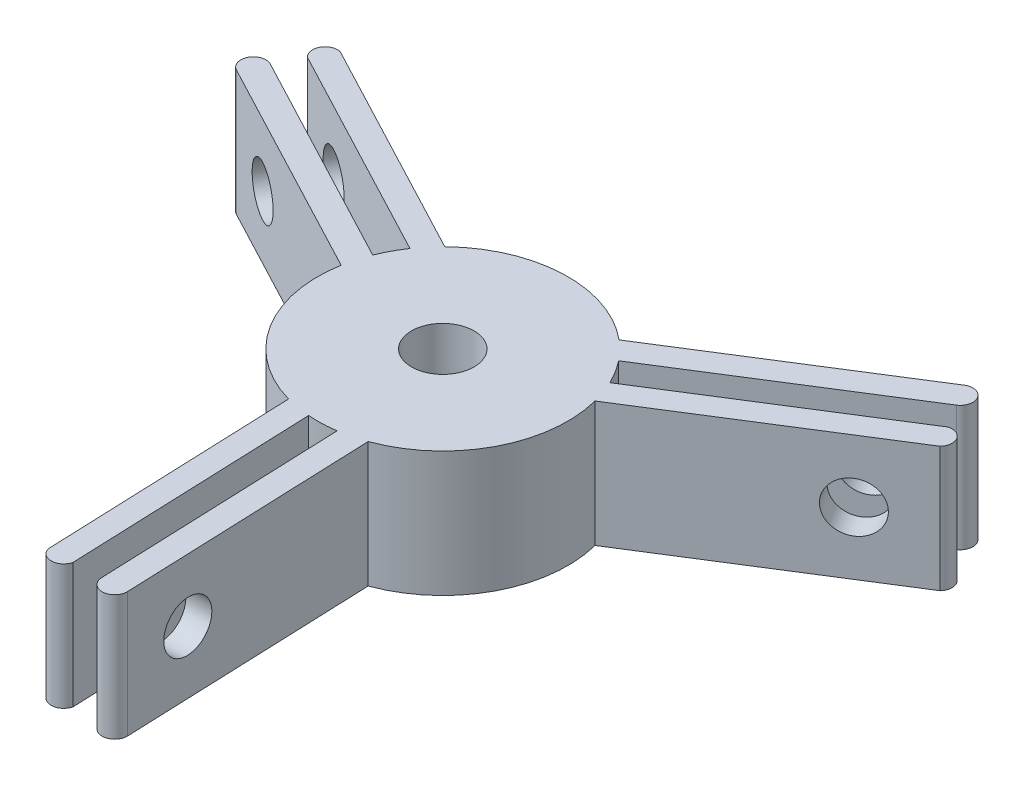
ISO-10303-21;
HEADER;
FILE_DESCRIPTION(('STEP AP214'),'2;1');
FILE_NAME('part.step','',(''),(''),'','','');
FILE_SCHEMA(('AUTOMOTIVE_DESIGN { 1 0 10303 214 1 1 1 1 }'));
ENDSEC;
DATA;
#1=APPLICATION_CONTEXT('core data for automotive mechanical design processes');
#2=APPLICATION_PROTOCOL_DEFINITION('international standard','automotive_design',2000,#1);
#3=PRODUCT_CONTEXT('',#1,'mechanical');
#4=PRODUCT('Part','Part','',(#3));
#5=PRODUCT_RELATED_PRODUCT_CATEGORY('part','',(#4));
#6=PRODUCT_DEFINITION_FORMATION('','',#4);
#7=PRODUCT_DEFINITION_CONTEXT('part definition',#1,'design');
#8=PRODUCT_DEFINITION('design','',#6,#7);
#9=PRODUCT_DEFINITION_SHAPE('','',#8);
#10=(LENGTH_UNIT() NAMED_UNIT(*) SI_UNIT(.MILLI.,.METRE.));
#11=(NAMED_UNIT(*) PLANE_ANGLE_UNIT() SI_UNIT($,.RADIAN.));
#12=(NAMED_UNIT(*) SI_UNIT($,.STERADIAN.) SOLID_ANGLE_UNIT());
#13=UNCERTAINTY_MEASURE_WITH_UNIT(LENGTH_MEASURE(1.E-05),#10,'distance_accuracy_value','');
#14=(GEOMETRIC_REPRESENTATION_CONTEXT(3) GLOBAL_UNCERTAINTY_ASSIGNED_CONTEXT((#13)) GLOBAL_UNIT_ASSIGNED_CONTEXT((#10,
#11,#12)) REPRESENTATION_CONTEXT('',''));
#15=CARTESIAN_POINT('',(0.,0.,0.));
#16=DIRECTION('',(0.,0.,1.));
#17=DIRECTION('',(1.,0.,0.));
#18=AXIS2_PLACEMENT_3D('',#15,#16,#17);
#19=CARTESIAN_POINT('',(0.,10.,0.));
#20=DIRECTION('',(0.,1.,0.));
#21=DIRECTION('',(0.,0.,1.));
#22=AXIS2_PLACEMENT_3D('',#19,#20,#21);
#23=PLANE('',#22);
#24=CARTESIAN_POINT('',(0.,10.,0.));
#25=DIRECTION('',(0.,1.,0.));
#26=DIRECTION('',(0.,0.,1.));
#27=AXIS2_PLACEMENT_3D('',#24,#25,#26);
#28=CIRCLE('',#27,10.);
#29=CARTESIAN_POINT('',(9.01148587106745,10.,-4.33510350459499));
#30=VERTEX_POINT('',#29);
#31=CARTESIAN_POINT('',(7.84546468512186,10.,-6.20070027291319));
#32=VERTEX_POINT('',#31);
#33=EDGE_CURVE('E275',#30,#32,#28,.T.);
#34=ORIENTED_EDGE('',*,*,#33,.T.);
#35=DIRECTION('',(0.846174424298782,0.,-0.532906036429149));
#36=VECTOR('',#35,1.);
#37=CARTESIAN_POINT('',(7.84546468512186,10.,-6.20070027291319));
#38=LINE('',#37,#36);
#39=CARTESIAN_POINT('',(24.4096415204676,10.,-16.6325327303295));
#40=VERTEX_POINT('',#39);
#41=EDGE_CURVE('E143',#32,#40,#38,.T.);
#42=ORIENTED_EDGE('',*,*,#41,.T.);
#43=CARTESIAN_POINT('',(23.8767354840384,10.,-17.4787071546283));
#44=DIRECTION('',(0.,1.,0.));
#45=DIRECTION('',(0.,0.,1.));
#46=AXIS2_PLACEMENT_3D('',#43,#44,#45);
#47=CIRCLE('',#46,1.);
#48=CARTESIAN_POINT('',(23.3438294476093,10.,-18.3248815789271));
#49=VERTEX_POINT('',#48);
#50=EDGE_CURVE('E338',#40,#49,#47,.T.);
#51=ORIENTED_EDGE('',*,*,#50,.T.);
#52=DIRECTION('',(-0.846174424298782,0.,0.532906036429149));
#53=VECTOR('',#52,1.);
#54=CARTESIAN_POINT('',(6.42034096163365,10.,-7.6667608503441));
#55=LINE('',#54,#53);
#56=CARTESIAN_POINT('',(6.42034096163365,10.,-7.6667608503441));
#57=VERTEX_POINT('',#56);
#58=EDGE_CURVE('E357',#49,#57,#55,.T.);
#59=ORIENTED_EDGE('',*,*,#58,.T.);
#60=CARTESIAN_POINT('',(0.,10.,0.));
#61=DIRECTION('',(0.,1.,0.));
#62=DIRECTION('',(0.,0.,1.));
#63=AXIS2_PLACEMENT_3D('',#60,#61,#62);
#64=CIRCLE('',#63,10.);
#65=CARTESIAN_POINT('',(-6.99010809505121,10.,-7.15111101993945));
#66=VERTEX_POINT('',#65);
#67=EDGE_CURVE('E354',#57,#66,#64,.T.);
#68=ORIENTED_EDGE('',*,*,#67,.T.);
#69=DIRECTION('',(-0.88459737752711,0.,-0.466355529260842));
#70=VECTOR('',#69,1.);
#71=CARTESIAN_POINT('',(-6.99010809505122,10.,-7.15111101993945));
#72=LINE('',#71,#70);
#73=CARTESIAN_POINT('',(-24.6820556455925,10.,-16.4782216051558));
#74=VERTEX_POINT('',#73);
#75=EDGE_CURVE('E356',#66,#74,#72,.T.);
#76=ORIENTED_EDGE('',*,*,#75,.T.);
#77=CARTESIAN_POINT('',(-24.9037683563406,10.,-15.5031095736985));
#78=DIRECTION('',(0.,1.,0.));
#79=DIRECTION('',(0.,0.,-1.));
#80=AXIS2_PLACEMENT_3D('',#77,#78,#79);
#81=CIRCLE('',#80,1.);
#82=CARTESIAN_POINT('',(-25.5830344696015,10.,-14.7692175193912));
#83=VERTEX_POINT('',#82);
#84=EDGE_CURVE('E359',#74,#83,#81,.T.);
#85=ORIENTED_EDGE('',*,*,#84,.T.);
#86=DIRECTION('',(0.88459737752711,0.,0.466355529260842));
#87=VECTOR('',#86,1.);
#88=CARTESIAN_POINT('',(-8.26005269854793,10.,-5.63662393789146));
#89=LINE('',#88,#87);
#90=CARTESIAN_POINT('',(-8.26005269854793,10.,-5.63662393789146));
#91=VERTEX_POINT('',#90);
#92=EDGE_CURVE('E365',#83,#91,#89,.T.);
#93=ORIENTED_EDGE('',*,*,#92,.T.);
#94=CARTESIAN_POINT('',(0.,10.,0.));
#95=DIRECTION('',(0.,1.,0.));
#96=DIRECTION('',(0.,0.,1.));
#97=AXIS2_PLACEMENT_3D('',#94,#95,#96);
#98=CIRCLE('',#97,10.);
#99=CARTESIAN_POINT('',(-9.29269630015686,10.,-3.69402158535262));
#100=VERTEX_POINT('',#99);
#101=EDGE_CURVE('E367',#91,#100,#98,.T.);
#102=ORIENTED_EDGE('',*,*,#101,.T.);
#103=DIRECTION('',(-0.88459737752711,0.,-0.466355529260842));
#104=VECTOR('',#103,1.);
#105=CARTESIAN_POINT('',(-9.29269630015686,10.,-3.69402158535262));
#106=LINE('',#105,#104);
#107=CARTESIAN_POINT('',(-26.6090166339753,10.,-12.8231032888316));
#108=VERTEX_POINT('',#107);
#109=EDGE_CURVE('E369',#100,#108,#106,.T.);
#110=ORIENTED_EDGE('',*,*,#109,.T.);
#111=CARTESIAN_POINT('',(-27.0753721632362,10.,-11.9385059113045));
#112=DIRECTION('',(0.,1.,0.));
#113=DIRECTION('',(0.,0.,1.));
#114=AXIS2_PLACEMENT_3D('',#111,#112,#113);
#115=CIRCLE('',#114,1.);
#116=CARTESIAN_POINT('',(-27.541727692497,10.,-11.0539085337773));
#117=VERTEX_POINT('',#116);
#118=EDGE_CURVE('E371',#108,#117,#115,.T.);
#119=ORIENTED_EDGE('',*,*,#118,.T.);
#120=DIRECTION('',(0.88459737752711,0.,0.466355529260842));
#121=VECTOR('',#120,1.);
#122=CARTESIAN_POINT('',(-9.8497801419548,10.,-1.7267979485605));
#123=LINE('',#122,#121);
#124=CARTESIAN_POINT('',(-9.8497801419548,10.,-1.7267979485605));
#125=VERTEX_POINT('',#124);
#126=EDGE_CURVE('E373',#117,#125,#123,.T.);
#127=ORIENTED_EDGE('',*,*,#126,.T.);
#128=CARTESIAN_POINT('',(0.,10.,0.));
#129=DIRECTION('',(0.,1.,0.));
#130=DIRECTION('',(0.,0.,1.));
#131=AXIS2_PLACEMENT_3D('',#128,#129,#130);
#132=CIRCLE('',#131,10.);
#133=CARTESIAN_POINT('',(-2.69798976102481,10.,9.62916669548333));
#134=VERTEX_POINT('',#133);
#135=EDGE_CURVE('E375',#125,#134,#132,.T.);
#136=ORIENTED_EDGE('',*,*,#135,.T.);
#137=DIRECTION('',(0.0384229532283287,0.,0.999261565689992));
#138=VECTOR('',#137,1.);
#139=CARTESIAN_POINT('',(-2.69798976102481,10.,9.62916669548333));
#140=LINE('',#139,#138);
#141=CARTESIAN_POINT('',(-1.92953069645827,10.,29.6143980092821));
#142=VERTEX_POINT('',#141);
#143=EDGE_CURVE('E377',#134,#142,#140,.T.);
#144=ORIENTED_EDGE('',*,*,#143,.T.);
#145=CARTESIAN_POINT('',(-0.974202550306361,10.,29.3188508334032));
#146=DIRECTION('',(0.,1.,0.));
#147=DIRECTION('',(0.,0.,-1.));
#148=AXIS2_PLACEMENT_3D('',#145,#146,#147);
#149=CIRCLE('',#148,0.999999999999999);
#150=CARTESIAN_POINT('',(0.000999668989778838,10.,29.5401665162634));
#151=VERTEX_POINT('',#150);
#152=EDGE_CURVE('E379',#142,#151,#149,.T.);
#153=ORIENTED_EDGE('',*,*,#152,.T.);
#154=DIRECTION('',(-0.0384229532283282,0.,-0.999261565689992));
#155=VECTOR('',#154,1.);
#156=CARTESIAN_POINT('',(-0.751433172519515,10.,9.97172744248644));
#157=LINE('',#156,#155);
#158=CARTESIAN_POINT('',(-0.751433172519515,10.,9.97172744248644));
#159=VERTEX_POINT('',#158);
#160=EDGE_CURVE('E381',#151,#159,#157,.T.);
#161=ORIENTED_EDGE('',*,*,#160,.T.);
#162=CARTESIAN_POINT('',(0.,10.,0.));
#163=DIRECTION('',(0.,1.,0.));
#164=DIRECTION('',(0.,0.,1.));
#165=AXIS2_PLACEMENT_3D('',#162,#163,#164);
#166=CIRCLE('',#165,10.);
#167=CARTESIAN_POINT('',(1.44723161503499,10.,9.89472185826581));
#168=VERTEX_POINT('',#167);
#169=EDGE_CURVE('E383',#159,#168,#166,.T.);
#170=ORIENTED_EDGE('',*,*,#169,.T.);
#171=DIRECTION('',(0.0384229532283283,0.,0.999261565689992));
#172=VECTOR('',#171,1.);
#173=CARTESIAN_POINT('',(1.44723161503499,10.,9.89472185826581));
#174=LINE('',#173,#172);
#175=CARTESIAN_POINT('',(2.19937511350774,10.,29.4556360191611));
#176=VERTEX_POINT('',#175);
#177=EDGE_CURVE('E385',#168,#176,#174,.T.);
#178=ORIENTED_EDGE('',*,*,#177,.T.);
#179=CARTESIAN_POINT('',(3.19863667919775,10.,29.4172130659328));
#180=DIRECTION('',(0.,1.,0.));
#181=DIRECTION('',(0.,0.,1.));
#182=AXIS2_PLACEMENT_3D('',#179,#180,#181);
#183=CIRCLE('',#182,1.);
#184=CARTESIAN_POINT('',(4.19789824488775,10.,29.3787901127044));
#185=VERTEX_POINT('',#184);
#186=EDGE_CURVE('E387',#176,#185,#183,.T.);
#187=ORIENTED_EDGE('',*,*,#186,.T.);
#188=DIRECTION('',(-0.0384229532283283,0.,-0.999261565689992));
#189=VECTOR('',#188,1.);
#190=CARTESIAN_POINT('',(3.42943918032116,10.,9.3935587989046));
#191=LINE('',#190,#189);
#192=CARTESIAN_POINT('',(3.42943918032116,10.,9.3935587989046));
#193=VERTEX_POINT('',#192);
#194=EDGE_CURVE('E389',#185,#193,#191,.T.);
#195=ORIENTED_EDGE('',*,*,#194,.T.);
#196=CARTESIAN_POINT('',(0.,10.,0.));
#197=DIRECTION('',(0.,1.,0.));
#198=DIRECTION('',(0.,0.,1.));
#199=AXIS2_PLACEMENT_3D('',#196,#197,#198);
#200=CIRCLE('',#199,10.);
#201=CARTESIAN_POINT('',(9.68809785607602,10.,-2.47805567554387));
#202=VERTEX_POINT('',#201);
#203=EDGE_CURVE('E210',#193,#202,#200,.T.);
#204=ORIENTED_EDGE('',*,*,#203,.T.);
#205=DIRECTION('',(0.846174424298781,0.,-0.53290603642915));
#206=VECTOR('',#205,1.);
#207=CARTESIAN_POINT('',(9.68809785607602,10.,-2.47805567554387));
#208=LINE('',#207,#206);
#209=CARTESIAN_POINT('',(26.6115863420508,10.,-13.1361764041263));
#210=VERTEX_POINT('',#209);
#211=EDGE_CURVE('E204',#202,#210,#208,.T.);
#212=ORIENTED_EDGE('',*,*,#211,.T.);
#213=CARTESIAN_POINT('',(25.8779709066469,10.,-13.8157412597047));
#214=DIRECTION('',(0.,1.,0.));
#215=DIRECTION('',(0.,0.,-1.));
#216=AXIS2_PLACEMENT_3D('',#213,#214,#215);
#217=CIRCLE('',#216,1.);
#218=CARTESIAN_POINT('',(25.5820348006117,10.,-14.7709489968722));
#219=VERTEX_POINT('',#218);
#220=EDGE_CURVE('E208',#210,#219,#217,.T.);
#221=ORIENTED_EDGE('',*,*,#220,.T.);
#222=DIRECTION('',(-0.846174424298781,0.,0.532906036429149));
#223=VECTOR('',#222,1.);
#224=CARTESIAN_POINT('',(9.01148587106745,10.,-4.33510350459499));
#225=LINE('',#224,#223);
#226=EDGE_CURVE('E52',#219,#30,#225,.T.);
#227=ORIENTED_EDGE('',*,*,#226,.T.);
#228=EDGE_LOOP('',(#34,#42,#51,#59,#68,#76,#85,#93,#102,#110,#119,#127,#136,#144,#153,#161,#170,
#178,#187,#195,#204,#212,#221,#227));
#229=FACE_BOUND('',#228,.T.);
#230=CARTESIAN_POINT('',(0.,10.,0.));
#231=DIRECTION('',(0.,1.,0.));
#232=DIRECTION('',(0.,0.,1.));
#233=AXIS2_PLACEMENT_3D('',#230,#231,#232);
#234=CIRCLE('',#233,2.5);
#235=CARTESIAN_POINT('',(0.,10.,2.5));
#236=VERTEX_POINT('',#235);
#237=EDGE_CURVE('E232',#236,#236,#234,.T.);
#238=ORIENTED_EDGE('',*,*,#237,.F.);
#239=EDGE_LOOP('',(#238));
#240=FACE_BOUND('',#239,.T.);
#241=ADVANCED_FACE('F35',(#229,#240),#23,.T.);
#242=CARTESIAN_POINT('',(0.,0.,0.));
#243=DIRECTION('',(0.,1.,0.));
#244=DIRECTION('',(0.,0.,1.));
#245=AXIS2_PLACEMENT_3D('',#242,#243,#244);
#246=PLANE('',#245);
#247=CARTESIAN_POINT('',(0.,0.,0.));
#248=DIRECTION('',(0.,1.,0.));
#249=DIRECTION('',(0.,0.,1.));
#250=AXIS2_PLACEMENT_3D('',#247,#248,#249);
#251=CIRCLE('',#250,10.);
#252=CARTESIAN_POINT('',(9.01148587106745,0.,-4.33510350459499));
#253=VERTEX_POINT('',#252);
#254=CARTESIAN_POINT('',(7.84546468512186,0.,-6.20070027291319));
#255=VERTEX_POINT('',#254);
#256=EDGE_CURVE('E228',#253,#255,#251,.T.);
#257=ORIENTED_EDGE('',*,*,#256,.F.);
#258=DIRECTION('',(-0.846174424298781,0.,0.532906036429149));
#259=VECTOR('',#258,1.);
#260=CARTESIAN_POINT('',(9.01148587106745,0.,-4.33510350459499));
#261=LINE('',#260,#259);
#262=CARTESIAN_POINT('',(25.5820348006117,0.,-14.7709489968722));
#263=VERTEX_POINT('',#262);
#264=EDGE_CURVE('E135',#263,#253,#261,.T.);
#265=ORIENTED_EDGE('',*,*,#264,.F.);
#266=CARTESIAN_POINT('',(25.8779709066469,0.,-13.8157412597047));
#267=DIRECTION('',(0.,1.,0.));
#268=DIRECTION('',(0.,0.,-1.));
#269=AXIS2_PLACEMENT_3D('',#266,#267,#268);
#270=CIRCLE('',#269,1.);
#271=CARTESIAN_POINT('',(26.6115863420508,0.,-13.1361764041263));
#272=VERTEX_POINT('',#271);
#273=EDGE_CURVE('E129',#272,#263,#270,.T.);
#274=ORIENTED_EDGE('',*,*,#273,.F.);
#275=DIRECTION('',(0.846174424298781,0.,-0.53290603642915));
#276=VECTOR('',#275,1.);
#277=CARTESIAN_POINT('',(9.68809785607602,0.,-2.47805567554387));
#278=LINE('',#277,#276);
#279=CARTESIAN_POINT('',(9.68809785607602,0.,-2.47805567554387));
#280=VERTEX_POINT('',#279);
#281=EDGE_CURVE('E218',#280,#272,#278,.T.);
#282=ORIENTED_EDGE('',*,*,#281,.F.);
#283=CARTESIAN_POINT('',(0.,0.,0.));
#284=DIRECTION('',(0.,1.,0.));
#285=DIRECTION('',(0.,0.,1.));
#286=AXIS2_PLACEMENT_3D('',#283,#284,#285);
#287=CIRCLE('',#286,10.);
#288=CARTESIAN_POINT('',(3.42943918032116,0.,9.3935587989046));
#289=VERTEX_POINT('',#288);
#290=EDGE_CURVE('E270',#289,#280,#287,.T.);
#291=ORIENTED_EDGE('',*,*,#290,.F.);
#292=DIRECTION('',(-0.0384229532283283,0.,-0.999261565689992));
#293=VECTOR('',#292,1.);
#294=CARTESIAN_POINT('',(3.42943918032116,0.,9.3935587989046));
#295=LINE('',#294,#293);
#296=CARTESIAN_POINT('',(4.19789824488775,0.,29.3787901127044));
#297=VERTEX_POINT('',#296);
#298=EDGE_CURVE('E268',#297,#289,#295,.T.);
#299=ORIENTED_EDGE('',*,*,#298,.F.);
#300=CARTESIAN_POINT('',(3.19863667919775,0.,29.4172130659328));
#301=DIRECTION('',(0.,1.,0.));
#302=DIRECTION('',(0.,0.,1.));
#303=AXIS2_PLACEMENT_3D('',#300,#301,#302);
#304=CIRCLE('',#303,1.);
#305=CARTESIAN_POINT('',(2.19937511350774,0.,29.4556360191611));
#306=VERTEX_POINT('',#305);
#307=EDGE_CURVE('E266',#306,#297,#304,.T.);
#308=ORIENTED_EDGE('',*,*,#307,.F.);
#309=DIRECTION('',(0.0384229532283283,0.,0.999261565689992));
#310=VECTOR('',#309,1.);
#311=CARTESIAN_POINT('',(1.44723161503499,0.,9.89472185826581));
#312=LINE('',#311,#310);
#313=CARTESIAN_POINT('',(1.44723161503499,0.,9.89472185826581));
#314=VERTEX_POINT('',#313);
#315=EDGE_CURVE('E264',#314,#306,#312,.T.);
#316=ORIENTED_EDGE('',*,*,#315,.F.);
#317=CARTESIAN_POINT('',(0.,0.,0.));
#318=DIRECTION('',(0.,1.,0.));
#319=DIRECTION('',(0.,0.,1.));
#320=AXIS2_PLACEMENT_3D('',#317,#318,#319);
#321=CIRCLE('',#320,10.);
#322=CARTESIAN_POINT('',(-0.751433172519515,0.,9.97172744248644));
#323=VERTEX_POINT('',#322);
#324=EDGE_CURVE('E262',#323,#314,#321,.T.);
#325=ORIENTED_EDGE('',*,*,#324,.F.);
#326=DIRECTION('',(-0.0384229532283282,0.,-0.999261565689992));
#327=VECTOR('',#326,1.);
#328=CARTESIAN_POINT('',(-0.751433172519515,0.,9.97172744248644));
#329=LINE('',#328,#327);
#330=CARTESIAN_POINT('',(0.000999668989778838,0.,29.5401665162634));
#331=VERTEX_POINT('',#330);
#332=EDGE_CURVE('E260',#331,#323,#329,.T.);
#333=ORIENTED_EDGE('',*,*,#332,.F.);
#334=CARTESIAN_POINT('',(-0.974202550306361,0.,29.3188508334032));
#335=DIRECTION('',(0.,1.,0.));
#336=DIRECTION('',(0.,0.,-1.));
#337=AXIS2_PLACEMENT_3D('',#334,#335,#336);
#338=CIRCLE('',#337,0.999999999999999);
#339=CARTESIAN_POINT('',(-1.92953069645827,0.,29.6143980092821));
#340=VERTEX_POINT('',#339);
#341=EDGE_CURVE('E258',#340,#331,#338,.T.);
#342=ORIENTED_EDGE('',*,*,#341,.F.);
#343=DIRECTION('',(0.0384229532283287,0.,0.999261565689992));
#344=VECTOR('',#343,1.);
#345=CARTESIAN_POINT('',(-2.69798976102481,0.,9.62916669548333));
#346=LINE('',#345,#344);
#347=CARTESIAN_POINT('',(-2.69798976102481,0.,9.62916669548333));
#348=VERTEX_POINT('',#347);
#349=EDGE_CURVE('E256',#348,#340,#346,.T.);
#350=ORIENTED_EDGE('',*,*,#349,.F.);
#351=CARTESIAN_POINT('',(0.,0.,0.));
#352=DIRECTION('',(0.,1.,0.));
#353=DIRECTION('',(0.,0.,1.));
#354=AXIS2_PLACEMENT_3D('',#351,#352,#353);
#355=CIRCLE('',#354,10.);
#356=CARTESIAN_POINT('',(-9.8497801419548,0.,-1.7267979485605));
#357=VERTEX_POINT('',#356);
#358=EDGE_CURVE('E254',#357,#348,#355,.T.);
#359=ORIENTED_EDGE('',*,*,#358,.F.);
#360=DIRECTION('',(0.88459737752711,0.,0.466355529260842));
#361=VECTOR('',#360,1.);
#362=CARTESIAN_POINT('',(-9.8497801419548,0.,-1.7267979485605));
#363=LINE('',#362,#361);
#364=CARTESIAN_POINT('',(-27.541727692497,0.,-11.0539085337773));
#365=VERTEX_POINT('',#364);
#366=EDGE_CURVE('E252',#365,#357,#363,.T.);
#367=ORIENTED_EDGE('',*,*,#366,.F.);
#368=CARTESIAN_POINT('',(-27.0753721632362,0.,-11.9385059113045));
#369=DIRECTION('',(0.,1.,0.));
#370=DIRECTION('',(0.,0.,1.));
#371=AXIS2_PLACEMENT_3D('',#368,#369,#370);
#372=CIRCLE('',#371,1.);
#373=CARTESIAN_POINT('',(-26.6090166339753,0.,-12.8231032888316));
#374=VERTEX_POINT('',#373);
#375=EDGE_CURVE('E250',#374,#365,#372,.T.);
#376=ORIENTED_EDGE('',*,*,#375,.F.);
#377=DIRECTION('',(-0.88459737752711,0.,-0.466355529260842));
#378=VECTOR('',#377,1.);
#379=CARTESIAN_POINT('',(-9.29269630015686,0.,-3.69402158535262));
#380=LINE('',#379,#378);
#381=CARTESIAN_POINT('',(-9.29269630015686,0.,-3.69402158535262));
#382=VERTEX_POINT('',#381);
#383=EDGE_CURVE('E248',#382,#374,#380,.T.);
#384=ORIENTED_EDGE('',*,*,#383,.F.);
#385=CARTESIAN_POINT('',(0.,0.,0.));
#386=DIRECTION('',(0.,1.,0.));
#387=DIRECTION('',(0.,0.,1.));
#388=AXIS2_PLACEMENT_3D('',#385,#386,#387);
#389=CIRCLE('',#388,10.);
#390=CARTESIAN_POINT('',(-8.26005269854793,0.,-5.63662393789146));
#391=VERTEX_POINT('',#390);
#392=EDGE_CURVE('E246',#391,#382,#389,.T.);
#393=ORIENTED_EDGE('',*,*,#392,.F.);
#394=DIRECTION('',(0.88459737752711,0.,0.466355529260842));
#395=VECTOR('',#394,1.);
#396=CARTESIAN_POINT('',(-8.26005269854793,0.,-5.63662393789146));
#397=LINE('',#396,#395);
#398=CARTESIAN_POINT('',(-25.5830344696015,0.,-14.7692175193912));
#399=VERTEX_POINT('',#398);
#400=EDGE_CURVE('E244',#399,#391,#397,.T.);
#401=ORIENTED_EDGE('',*,*,#400,.F.);
#402=CARTESIAN_POINT('',(-24.9037683563406,0.,-15.5031095736985));
#403=DIRECTION('',(0.,1.,0.));
#404=DIRECTION('',(0.,0.,-1.));
#405=AXIS2_PLACEMENT_3D('',#402,#403,#404);
#406=CIRCLE('',#405,1.);
#407=CARTESIAN_POINT('',(-24.6820556455925,0.,-16.4782216051558));
#408=VERTEX_POINT('',#407);
#409=EDGE_CURVE('E242',#408,#399,#406,.T.);
#410=ORIENTED_EDGE('',*,*,#409,.F.);
#411=DIRECTION('',(-0.88459737752711,0.,-0.466355529260842));
#412=VECTOR('',#411,1.);
#413=CARTESIAN_POINT('',(-6.99010809505122,0.,-7.15111101993945));
#414=LINE('',#413,#412);
#415=CARTESIAN_POINT('',(-6.99010809505121,0.,-7.15111101993945));
#416=VERTEX_POINT('',#415);
#417=EDGE_CURVE('E240',#416,#408,#414,.T.);
#418=ORIENTED_EDGE('',*,*,#417,.F.);
#419=CARTESIAN_POINT('',(0.,0.,0.));
#420=DIRECTION('',(0.,1.,0.));
#421=DIRECTION('',(0.,0.,1.));
#422=AXIS2_PLACEMENT_3D('',#419,#420,#421);
#423=CIRCLE('',#422,10.);
#424=CARTESIAN_POINT('',(6.42034096163365,0.,-7.6667608503441));
#425=VERTEX_POINT('',#424);
#426=EDGE_CURVE('E238',#425,#416,#423,.T.);
#427=ORIENTED_EDGE('',*,*,#426,.F.);
#428=DIRECTION('',(-0.846174424298782,0.,0.532906036429149));
#429=VECTOR('',#428,1.);
#430=CARTESIAN_POINT('',(6.42034096163365,0.,-7.6667608503441));
#431=LINE('',#430,#429);
#432=CARTESIAN_POINT('',(23.3438294476093,0.,-18.3248815789271));
#433=VERTEX_POINT('',#432);
#434=EDGE_CURVE('E236',#433,#425,#431,.T.);
#435=ORIENTED_EDGE('',*,*,#434,.F.);
#436=CARTESIAN_POINT('',(23.8767354840384,0.,-17.4787071546283));
#437=DIRECTION('',(0.,1.,0.));
#438=DIRECTION('',(0.,0.,1.));
#439=AXIS2_PLACEMENT_3D('',#436,#437,#438);
#440=CIRCLE('',#439,1.);
#441=CARTESIAN_POINT('',(24.4096415204676,0.,-16.6325327303295));
#442=VERTEX_POINT('',#441);
#443=EDGE_CURVE('E234',#442,#433,#440,.T.);
#444=ORIENTED_EDGE('',*,*,#443,.F.);
#445=DIRECTION('',(0.846174424298782,0.,-0.532906036429149));
#446=VECTOR('',#445,1.);
#447=CARTESIAN_POINT('',(7.84546468512186,0.,-6.20070027291319));
#448=LINE('',#447,#446);
#449=EDGE_CURVE('E231',#255,#442,#448,.T.);
#450=ORIENTED_EDGE('',*,*,#449,.F.);
#451=EDGE_LOOP('',(#257,#265,#274,#282,#291,#299,#308,#316,#325,#333,#342,#350,#359,#367,#376,
#384,#393,#401,#410,#418,#427,#435,#444,#450));
#452=FACE_BOUND('',#451,.T.);
#453=CARTESIAN_POINT('',(0.,0.,0.));
#454=DIRECTION('',(0.,1.,0.));
#455=DIRECTION('',(0.,0.,1.));
#456=AXIS2_PLACEMENT_3D('',#453,#454,#455);
#457=CIRCLE('',#456,2.5);
#458=CARTESIAN_POINT('',(0.,0.,2.5));
#459=VERTEX_POINT('',#458);
#460=EDGE_CURVE('E485',#459,#459,#457,.T.);
#461=ORIENTED_EDGE('',*,*,#460,.T.);
#462=EDGE_LOOP('',(#461));
#463=FACE_BOUND('',#462,.T.);
#464=ADVANCED_FACE('F342',(#452,#463),#246,.F.);
#465=CARTESIAN_POINT('',(0.,10.,0.));
#466=DIRECTION('',(0.,-1.,0.));
#467=DIRECTION('',(0.,0.,-1.));
#468=AXIS2_PLACEMENT_3D('',#465,#466,#467);
#469=CYLINDRICAL_SURFACE('',#468,10.);
#470=ORIENTED_EDGE('',*,*,#256,.T.);
#471=DIRECTION('',(0.,-1.,0.));
#472=VECTOR('',#471,1.);
#473=CARTESIAN_POINT('',(7.84546468512186,10.,-6.20070027291319));
#474=LINE('',#473,#472);
#475=EDGE_CURVE('E11',#32,#255,#474,.T.);
#476=ORIENTED_EDGE('',*,*,#475,.F.);
#477=ORIENTED_EDGE('',*,*,#33,.F.);
#478=DIRECTION('',(0.,-1.,0.));
#479=VECTOR('',#478,1.);
#480=CARTESIAN_POINT('',(9.01148587106745,10.,-4.33510350459499));
#481=LINE('',#480,#479);
#482=EDGE_CURVE('E224',#30,#253,#481,.T.);
#483=ORIENTED_EDGE('',*,*,#482,.T.);
#484=EDGE_LOOP('',(#470,#476,#477,#483));
#485=FACE_BOUND('',#484,.T.);
#486=ADVANCED_FACE('F37',(#485),#469,.T.);
#487=CARTESIAN_POINT('',(7.84546468512186,10.,-6.20070027291319));
#488=DIRECTION('',(-0.532906036429149,0.,-0.846174424298782));
#489=DIRECTION('',(-0.846174424298782,0.,0.532906036429149));
#490=AXIS2_PLACEMENT_3D('',#487,#488,#489);
#491=PLANE('',#490);
#492=CARTESIAN_POINT('',(20.1787693989738,5.,-13.9680025481836));
#493=DIRECTION('',(-0.532906036429142,0.,-0.846174424298786));
#494=DIRECTION('',(-0.846174424298786,0.,0.532906036429142));
#495=AXIS2_PLACEMENT_3D('',#492,#493,#494);
#496=CIRCLE('',#495,2.);
#497=CARTESIAN_POINT('',(18.4864205503762,5.,-12.9021904753253));
#498=VERTEX_POINT('',#497);
#499=EDGE_CURVE('E451',#498,#498,#496,.T.);
#500=ORIENTED_EDGE('',*,*,#499,.T.);
#501=EDGE_LOOP('',(#500));
#502=FACE_BOUND('',#501,.T.);
#503=ORIENTED_EDGE('',*,*,#449,.T.);
#504=DIRECTION('',(0.,-1.,0.));
#505=VECTOR('',#504,1.);
#506=CARTESIAN_POINT('',(24.4096415204676,10.,-16.6325327303295));
#507=LINE('',#506,#505);
#508=EDGE_CURVE('E44',#40,#442,#507,.T.);
#509=ORIENTED_EDGE('',*,*,#508,.F.);
#510=ORIENTED_EDGE('',*,*,#41,.F.);
#511=ORIENTED_EDGE('',*,*,#475,.T.);
#512=EDGE_LOOP('',(#503,#509,#510,#511));
#513=FACE_BOUND('',#512,.T.);
#514=ADVANCED_FACE('F575',(#502,#513),#491,.F.);
#515=CARTESIAN_POINT('',(23.8767354840384,10.,-17.4787071546283));
#516=DIRECTION('',(0.,-1.,0.));
#517=DIRECTION('',(0.,0.,-1.));
#518=AXIS2_PLACEMENT_3D('',#515,#516,#517);
#519=CYLINDRICAL_SURFACE('',#518,1.);
#520=ORIENTED_EDGE('',*,*,#443,.T.);
#521=DIRECTION('',(0.,-1.,0.));
#522=VECTOR('',#521,1.);
#523=CARTESIAN_POINT('',(23.3438294476093,10.,-18.3248815789271));
#524=LINE('',#523,#522);
#525=EDGE_CURVE('E330',#49,#433,#524,.T.);
#526=ORIENTED_EDGE('',*,*,#525,.F.);
#527=ORIENTED_EDGE('',*,*,#50,.F.);
#528=ORIENTED_EDGE('',*,*,#508,.T.);
#529=EDGE_LOOP('',(#520,#526,#527,#528));
#530=FACE_BOUND('',#529,.T.);
#531=ADVANCED_FACE('F336',(#530),#519,.T.);
#532=CARTESIAN_POINT('',(6.42034096163365,10.,-7.6667608503441));
#533=DIRECTION('',(0.532906036429149,0.,0.846174424298782));
#534=DIRECTION('',(0.846174424298782,0.,-0.532906036429149));
#535=AXIS2_PLACEMENT_3D('',#532,#533,#534);
#536=PLANE('',#535);
#537=CARTESIAN_POINT('',(19.1129573261155,5.,-15.6603513967812));
#538=DIRECTION('',(-0.532906036429142,0.,-0.846174424298786));
#539=DIRECTION('',(-0.846174424298786,0.,0.532906036429142));
#540=AXIS2_PLACEMENT_3D('',#537,#538,#539);
#541=CIRCLE('',#540,2.);
#542=CARTESIAN_POINT('',(17.4206084775179,5.,-14.5945393239229));
#543=VERTEX_POINT('',#542);
#544=EDGE_CURVE('E448',#543,#543,#541,.T.);
#545=ORIENTED_EDGE('',*,*,#544,.F.);
#546=EDGE_LOOP('',(#545));
#547=FACE_BOUND('',#546,.T.);
#548=ORIENTED_EDGE('',*,*,#434,.T.);
#549=DIRECTION('',(0.,-1.,0.));
#550=VECTOR('',#549,1.);
#551=CARTESIAN_POINT('',(6.42034096163365,10.,-7.6667608503441));
#552=LINE('',#551,#550);
#553=EDGE_CURVE('E327',#57,#425,#552,.T.);
#554=ORIENTED_EDGE('',*,*,#553,.F.);
#555=ORIENTED_EDGE('',*,*,#58,.F.);
#556=ORIENTED_EDGE('',*,*,#525,.T.);
#557=EDGE_LOOP('',(#548,#554,#555,#556));
#558=FACE_BOUND('',#557,.T.);
#559=ADVANCED_FACE('F348',(#547,#558),#536,.F.);
#560=CARTESIAN_POINT('',(0.,10.,0.));
#561=DIRECTION('',(0.,-1.,0.));
#562=DIRECTION('',(0.,0.,-1.));
#563=AXIS2_PLACEMENT_3D('',#560,#561,#562);
#564=CYLINDRICAL_SURFACE('',#563,10.);
#565=ORIENTED_EDGE('',*,*,#426,.T.);
#566=DIRECTION('',(0.,-1.,0.));
#567=VECTOR('',#566,1.);
#568=CARTESIAN_POINT('',(-6.99010809505121,10.,-7.15111101993945));
#569=LINE('',#568,#567);
#570=EDGE_CURVE('E324',#66,#416,#569,.T.);
#571=ORIENTED_EDGE('',*,*,#570,.F.);
#572=ORIENTED_EDGE('',*,*,#67,.F.);
#573=ORIENTED_EDGE('',*,*,#553,.T.);
#574=EDGE_LOOP('',(#565,#571,#572,#573));
#575=FACE_BOUND('',#574,.T.);
#576=ADVANCED_FACE('F352',(#575),#564,.T.);
#577=CARTESIAN_POINT('',(-6.99010809505122,10.,-7.15111101993945));
#578=DIRECTION('',(-0.466355529260842,0.,0.88459737752711));
#579=DIRECTION('',(0.88459737752711,0.,0.466355529260842));
#580=AXIS2_PLACEMENT_3D('',#577,#578,#579);
#581=PLANE('',#580);
#582=CARTESIAN_POINT('',(-20.259068757957,5.,-14.1464439588517));
#583=DIRECTION('',(-0.466355529260846,0.,0.884597377527108));
#584=DIRECTION('',(0.884597377527108,0.,0.466355529260846));
#585=AXIS2_PLACEMENT_3D('',#582,#583,#584);
#586=CIRCLE('',#585,2.);
#587=CARTESIAN_POINT('',(-18.4898740029028,5.,-13.2137329003301));
#588=VERTEX_POINT('',#587);
#589=EDGE_CURVE('E470',#588,#588,#586,.T.);
#590=ORIENTED_EDGE('',*,*,#589,.T.);
#591=EDGE_LOOP('',(#590));
#592=FACE_BOUND('',#591,.T.);
#593=ORIENTED_EDGE('',*,*,#417,.T.);
#594=DIRECTION('',(0.,-1.,0.));
#595=VECTOR('',#594,1.);
#596=CARTESIAN_POINT('',(-24.6820556455925,10.,-16.4782216051558));
#597=LINE('',#596,#595);
#598=EDGE_CURVE('E321',#74,#408,#597,.T.);
#599=ORIENTED_EDGE('',*,*,#598,.F.);
#600=ORIENTED_EDGE('',*,*,#75,.F.);
#601=ORIENTED_EDGE('',*,*,#570,.T.);
#602=EDGE_LOOP('',(#593,#599,#600,#601));
#603=FACE_BOUND('',#602,.T.);
#604=ADVANCED_FACE('F559',(#592,#603),#581,.F.);
#605=CARTESIAN_POINT('',(-24.9037683563406,10.,-15.5031095736985));
#606=DIRECTION('',(0.,-1.,0.));
#607=DIRECTION('',(0.,0.,-1.));
#608=AXIS2_PLACEMENT_3D('',#605,#606,#607);
#609=CYLINDRICAL_SURFACE('',#608,1.);
#610=ORIENTED_EDGE('',*,*,#409,.T.);
#611=DIRECTION('',(0.,-1.,0.));
#612=VECTOR('',#611,1.);
#613=CARTESIAN_POINT('',(-25.5830344696015,10.,-14.7692175193912));
#614=LINE('',#613,#612);
#615=EDGE_CURVE('E318',#83,#399,#614,.T.);
#616=ORIENTED_EDGE('',*,*,#615,.F.);
#617=ORIENTED_EDGE('',*,*,#84,.F.);
#618=ORIENTED_EDGE('',*,*,#598,.T.);
#619=EDGE_LOOP('',(#610,#616,#617,#618));
#620=FACE_BOUND('',#619,.T.);
#621=ADVANCED_FACE('F556',(#620),#609,.T.);
#622=CARTESIAN_POINT('',(-8.26005269854793,10.,-5.63662393789146));
#623=DIRECTION('',(0.466355529260842,0.,-0.88459737752711));
#624=DIRECTION('',(-0.88459737752711,0.,-0.466355529260842));
#625=AXIS2_PLACEMENT_3D('',#622,#623,#624);
#626=PLANE('',#625);
#627=CARTESIAN_POINT('',(-21.1600475819659,5.,-12.4374398730871));
#628=DIRECTION('',(0.466355529260847,0.,-0.884597377527108));
#629=DIRECTION('',(-0.884597377527108,0.,-0.466355529260847));
#630=AXIS2_PLACEMENT_3D('',#627,#628,#629);
#631=CIRCLE('',#630,2.);
#632=CARTESIAN_POINT('',(-22.9292423370201,5.,-13.3701509316088));
#633=VERTEX_POINT('',#632);
#634=EDGE_CURVE('E467',#633,#633,#631,.T.);
#635=ORIENTED_EDGE('',*,*,#634,.T.);
#636=EDGE_LOOP('',(#635));
#637=FACE_BOUND('',#636,.T.);
#638=ORIENTED_EDGE('',*,*,#400,.T.);
#639=DIRECTION('',(0.,-1.,0.));
#640=VECTOR('',#639,1.);
#641=CARTESIAN_POINT('',(-8.26005269854793,10.,-5.63662393789146));
#642=LINE('',#641,#640);
#643=EDGE_CURVE('E315',#91,#391,#642,.T.);
#644=ORIENTED_EDGE('',*,*,#643,.F.);
#645=ORIENTED_EDGE('',*,*,#92,.F.);
#646=ORIENTED_EDGE('',*,*,#615,.T.);
#647=EDGE_LOOP('',(#638,#644,#645,#646));
#648=FACE_BOUND('',#647,.T.);
#649=ADVANCED_FACE('F552',(#637,#648),#626,.F.);
#650=CARTESIAN_POINT('',(0.,10.,0.));
#651=DIRECTION('',(0.,-1.,0.));
#652=DIRECTION('',(0.,0.,-1.));
#653=AXIS2_PLACEMENT_3D('',#650,#651,#652);
#654=CYLINDRICAL_SURFACE('',#653,10.);
#655=ORIENTED_EDGE('',*,*,#392,.T.);
#656=DIRECTION('',(0.,-1.,0.));
#657=VECTOR('',#656,1.);
#658=CARTESIAN_POINT('',(-9.29269630015686,10.,-3.69402158535262));
#659=LINE('',#658,#657);
#660=EDGE_CURVE('E312',#100,#382,#659,.T.);
#661=ORIENTED_EDGE('',*,*,#660,.F.);
#662=ORIENTED_EDGE('',*,*,#101,.F.);
#663=ORIENTED_EDGE('',*,*,#643,.T.);
#664=EDGE_LOOP('',(#655,#661,#662,#663));
#665=FACE_BOUND('',#664,.T.);
#666=ADVANCED_FACE('F547',(#665),#654,.T.);
#667=CARTESIAN_POINT('',(-9.29269630015686,10.,-3.69402158535262));
#668=DIRECTION('',(-0.466355529260842,0.,0.88459737752711));
#669=DIRECTION('',(0.88459737752711,0.,0.466355529260842));
#670=AXIS2_PLACEMENT_3D('',#667,#668,#669);
#671=PLANE('',#670);
#672=CARTESIAN_POINT('',(-22.1860297463397,5.,-10.4913256425275));
#673=DIRECTION('',(-0.466355529260846,0.,0.884597377527108));
#674=DIRECTION('',(0.884597377527108,0.,0.466355529260846));
#675=AXIS2_PLACEMENT_3D('',#672,#673,#674);
#676=CIRCLE('',#675,2.);
#677=CARTESIAN_POINT('',(-20.4168349912855,5.,-9.55861458400577));
#678=VERTEX_POINT('',#677);
#679=EDGE_CURVE('E456',#678,#678,#676,.T.);
#680=ORIENTED_EDGE('',*,*,#679,.T.);
#681=EDGE_LOOP('',(#680));
#682=FACE_BOUND('',#681,.T.);
#683=ORIENTED_EDGE('',*,*,#383,.T.);
#684=DIRECTION('',(0.,-1.,0.));
#685=VECTOR('',#684,1.);
#686=CARTESIAN_POINT('',(-26.6090166339753,10.,-12.8231032888316));
#687=LINE('',#686,#685);
#688=EDGE_CURVE('E309',#108,#374,#687,.T.);
#689=ORIENTED_EDGE('',*,*,#688,.F.);
#690=ORIENTED_EDGE('',*,*,#109,.F.);
#691=ORIENTED_EDGE('',*,*,#660,.T.);
#692=EDGE_LOOP('',(#683,#689,#690,#691));
#693=FACE_BOUND('',#692,.T.);
#694=ADVANCED_FACE('F541',(#682,#693),#671,.F.);
#695=CARTESIAN_POINT('',(-27.0753721632362,10.,-11.9385059113045));
#696=DIRECTION('',(0.,-1.,0.));
#697=DIRECTION('',(0.,0.,-1.));
#698=AXIS2_PLACEMENT_3D('',#695,#696,#697);
#699=CYLINDRICAL_SURFACE('',#698,1.);
#700=ORIENTED_EDGE('',*,*,#375,.T.);
#701=DIRECTION('',(0.,-1.,0.));
#702=VECTOR('',#701,1.);
#703=CARTESIAN_POINT('',(-27.541727692497,10.,-11.0539085337773));
#704=LINE('',#703,#702);
#705=EDGE_CURVE('E306',#117,#365,#704,.T.);
#706=ORIENTED_EDGE('',*,*,#705,.F.);
#707=ORIENTED_EDGE('',*,*,#118,.F.);
#708=ORIENTED_EDGE('',*,*,#688,.T.);
#709=EDGE_LOOP('',(#700,#706,#707,#708));
#710=FACE_BOUND('',#709,.T.);
#711=ADVANCED_FACE('F537',(#710),#699,.T.);
#712=CARTESIAN_POINT('',(-9.8497801419548,10.,-1.7267979485605));
#713=DIRECTION('',(0.466355529260842,0.,-0.88459737752711));
#714=DIRECTION('',(-0.88459737752711,0.,-0.466355529260842));
#715=AXIS2_PLACEMENT_3D('',#712,#713,#714);
#716=PLANE('',#715);
#717=CARTESIAN_POINT('',(-23.1187408048614,5.,-8.72213088747325));
#718=DIRECTION('',(-0.466355529260847,0.,0.884597377527108));
#719=DIRECTION('',(0.884597377527108,0.,0.466355529260847));
#720=AXIS2_PLACEMENT_3D('',#717,#718,#719);
#721=CIRCLE('',#720,2.);
#722=CARTESIAN_POINT('',(-21.3495460498072,5.,-7.78941982895156));
#723=VERTEX_POINT('',#722);
#724=EDGE_CURVE('E453',#723,#723,#721,.T.);
#725=ORIENTED_EDGE('',*,*,#724,.F.);
#726=EDGE_LOOP('',(#725));
#727=FACE_BOUND('',#726,.T.);
#728=ORIENTED_EDGE('',*,*,#366,.T.);
#729=DIRECTION('',(0.,-1.,0.));
#730=VECTOR('',#729,1.);
#731=CARTESIAN_POINT('',(-9.8497801419548,10.,-1.7267979485605));
#732=LINE('',#731,#730);
#733=EDGE_CURVE('E303',#125,#357,#732,.T.);
#734=ORIENTED_EDGE('',*,*,#733,.F.);
#735=ORIENTED_EDGE('',*,*,#126,.F.);
#736=ORIENTED_EDGE('',*,*,#705,.T.);
#737=EDGE_LOOP('',(#728,#734,#735,#736));
#738=FACE_BOUND('',#737,.T.);
#739=ADVANCED_FACE('F533',(#727,#738),#716,.F.);
#740=CARTESIAN_POINT('',(0.,10.,0.));
#741=DIRECTION('',(0.,-1.,0.));
#742=DIRECTION('',(0.,0.,-1.));
#743=AXIS2_PLACEMENT_3D('',#740,#741,#742);
#744=CYLINDRICAL_SURFACE('',#743,10.);
#745=ORIENTED_EDGE('',*,*,#358,.T.);
#746=DIRECTION('',(0.,-1.,0.));
#747=VECTOR('',#746,1.);
#748=CARTESIAN_POINT('',(-2.69798976102481,10.,9.62916669548333));
#749=LINE('',#748,#747);
#750=EDGE_CURVE('E300',#134,#348,#749,.T.);
#751=ORIENTED_EDGE('',*,*,#750,.F.);
#752=ORIENTED_EDGE('',*,*,#135,.F.);
#753=ORIENTED_EDGE('',*,*,#733,.T.);
#754=EDGE_LOOP('',(#745,#751,#752,#753));
#755=FACE_BOUND('',#754,.T.);
#756=ADVANCED_FACE('F501',(#755),#744,.T.);
#757=CARTESIAN_POINT('',(-2.69798976102481,10.,9.62916669548333));
#758=DIRECTION('',(0.999261565689992,0.,-0.0384229532283287));
#759=DIRECTION('',(-0.0384229532283287,0.,-0.999261565689992));
#760=AXIS2_PLACEMENT_3D('',#757,#758,#759);
#761=PLANE('',#760);
#762=CARTESIAN_POINT('',(-2.12164546259991,5.,24.6180901808323));
#763=DIRECTION('',(0.999261565689992,0.,-0.0384229532283287));
#764=DIRECTION('',(-0.0384229532283287,0.,-0.999261565689992));
#765=AXIS2_PLACEMENT_3D('',#762,#763,#764);
#766=CIRCLE('',#765,2.);
#767=CARTESIAN_POINT('',(-2.19849136905657,5.,22.6195670494523));
#768=VERTEX_POINT('',#767);
#769=EDGE_CURVE('E482',#768,#768,#766,.T.);
#770=ORIENTED_EDGE('',*,*,#769,.T.);
#771=EDGE_LOOP('',(#770));
#772=FACE_BOUND('',#771,.T.);
#773=ORIENTED_EDGE('',*,*,#349,.T.);
#774=DIRECTION('',(0.,-1.,0.));
#775=VECTOR('',#774,1.);
#776=CARTESIAN_POINT('',(-1.92953069645827,10.,29.6143980092821));
#777=LINE('',#776,#775);
#778=EDGE_CURVE('E297',#142,#340,#777,.T.);
#779=ORIENTED_EDGE('',*,*,#778,.F.);
#780=ORIENTED_EDGE('',*,*,#143,.F.);
#781=ORIENTED_EDGE('',*,*,#750,.T.);
#782=EDGE_LOOP('',(#773,#779,#780,#781));
#783=FACE_BOUND('',#782,.T.);
#784=ADVANCED_FACE('F496',(#772,#783),#761,.F.);
#785=CARTESIAN_POINT('',(-0.974202550306361,10.,29.3188508334032));
#786=DIRECTION('',(0.,-1.,0.));
#787=DIRECTION('',(0.,0.,-1.));
#788=AXIS2_PLACEMENT_3D('',#785,#786,#787);
#789=CYLINDRICAL_SURFACE('',#788,0.999999999999999);
#790=ORIENTED_EDGE('',*,*,#341,.T.);
#791=DIRECTION('',(0.,-1.,0.));
#792=VECTOR('',#791,1.);
#793=CARTESIAN_POINT('',(0.000999668989778838,10.,29.5401665162634));
#794=LINE('',#793,#792);
#795=EDGE_CURVE('E294',#151,#331,#794,.T.);
#796=ORIENTED_EDGE('',*,*,#795,.F.);
#797=ORIENTED_EDGE('',*,*,#152,.F.);
#798=ORIENTED_EDGE('',*,*,#778,.T.);
#799=EDGE_LOOP('',(#790,#796,#797,#798));
#800=FACE_BOUND('',#799,.T.);
#801=ADVANCED_FACE('F500',(#800),#789,.T.);
#802=CARTESIAN_POINT('',(-0.751433172519515,10.,9.97172744248644));
#803=DIRECTION('',(-0.999261565689992,0.,0.0384229532283282));
#804=DIRECTION('',(0.0384229532283282,0.,0.999261565689992));
#805=AXIS2_PLACEMENT_3D('',#802,#803,#804);
#806=PLANE('',#805);
#807=CARTESIAN_POINT('',(-0.191115097151883,5.,24.5438586878135));
#808=DIRECTION('',(-0.999261565689992,0.,0.0384229532283282));
#809=DIRECTION('',(0.0384229532283282,0.,0.999261565689992));
#810=AXIS2_PLACEMENT_3D('',#807,#808,#809);
#811=CIRCLE('',#810,2.);
#812=CARTESIAN_POINT('',(-0.114269190695227,5.,26.5423818191935));
#813=VERTEX_POINT('',#812);
#814=EDGE_CURVE('E479',#813,#813,#811,.T.);
#815=ORIENTED_EDGE('',*,*,#814,.T.);
#816=EDGE_LOOP('',(#815));
#817=FACE_BOUND('',#816,.T.);
#818=ORIENTED_EDGE('',*,*,#332,.T.);
#819=DIRECTION('',(0.,-1.,0.));
#820=VECTOR('',#819,1.);
#821=CARTESIAN_POINT('',(-0.751433172519515,10.,9.97172744248644));
#822=LINE('',#821,#820);
#823=EDGE_CURVE('E291',#159,#323,#822,.T.);
#824=ORIENTED_EDGE('',*,*,#823,.F.);
#825=ORIENTED_EDGE('',*,*,#160,.F.);
#826=ORIENTED_EDGE('',*,*,#795,.T.);
#827=EDGE_LOOP('',(#818,#824,#825,#826));
#828=FACE_BOUND('',#827,.T.);
#829=ADVANCED_FACE('F517',(#817,#828),#806,.F.);
#830=CARTESIAN_POINT('',(0.,10.,0.));
#831=DIRECTION('',(0.,-1.,0.));
#832=DIRECTION('',(0.,0.,-1.));
#833=AXIS2_PLACEMENT_3D('',#830,#831,#832);
#834=CYLINDRICAL_SURFACE('',#833,10.);
#835=ORIENTED_EDGE('',*,*,#324,.T.);
#836=DIRECTION('',(0.,-1.,0.));
#837=VECTOR('',#836,1.);
#838=CARTESIAN_POINT('',(1.44723161503499,10.,9.89472185826581));
#839=LINE('',#838,#837);
#840=EDGE_CURVE('E288',#168,#314,#839,.T.);
#841=ORIENTED_EDGE('',*,*,#840,.F.);
#842=ORIENTED_EDGE('',*,*,#169,.F.);
#843=ORIENTED_EDGE('',*,*,#823,.T.);
#844=EDGE_LOOP('',(#835,#841,#842,#843));
#845=FACE_BOUND('',#844,.T.);
#846=ADVANCED_FACE('F521',(#845),#834,.T.);
#847=CARTESIAN_POINT('',(1.44723161503499,10.,9.89472185826581));
#848=DIRECTION('',(0.999261565689992,0.,-0.0384229532283283));
#849=DIRECTION('',(-0.0384229532283283,0.,-0.999261565689992));
#850=AXIS2_PLACEMENT_3D('',#847,#848,#849);
#851=PLANE('',#850);
#852=CARTESIAN_POINT('',(2.0072603473661,5.,24.4593281907112));
#853=DIRECTION('',(0.999261565689992,0.,-0.0384229532283283));
#854=DIRECTION('',(-0.0384229532283283,0.,-0.999261565689992));
#855=AXIS2_PLACEMENT_3D('',#852,#853,#854);
#856=CIRCLE('',#855,2.);
#857=CARTESIAN_POINT('',(1.93041444090944,5.,22.4608050593312));
#858=VERTEX_POINT('',#857);
#859=EDGE_CURVE('E476',#858,#858,#856,.T.);
#860=ORIENTED_EDGE('',*,*,#859,.T.);
#861=EDGE_LOOP('',(#860));
#862=FACE_BOUND('',#861,.T.);
#863=ORIENTED_EDGE('',*,*,#315,.T.);
#864=DIRECTION('',(0.,-1.,0.));
#865=VECTOR('',#864,1.);
#866=CARTESIAN_POINT('',(2.19937511350774,10.,29.4556360191611));
#867=LINE('',#866,#865);
#868=EDGE_CURVE('E285',#176,#306,#867,.T.);
#869=ORIENTED_EDGE('',*,*,#868,.F.);
#870=ORIENTED_EDGE('',*,*,#177,.F.);
#871=ORIENTED_EDGE('',*,*,#840,.T.);
#872=EDGE_LOOP('',(#863,#869,#870,#871));
#873=FACE_BOUND('',#872,.T.);
#874=ADVANCED_FACE('F698',(#862,#873),#851,.F.);
#875=CARTESIAN_POINT('',(3.19863667919775,10.,29.4172130659328));
#876=DIRECTION('',(0.,-1.,0.));
#877=DIRECTION('',(0.,0.,-1.));
#878=AXIS2_PLACEMENT_3D('',#875,#876,#877);
#879=CYLINDRICAL_SURFACE('',#878,1.);
#880=ORIENTED_EDGE('',*,*,#307,.T.);
#881=DIRECTION('',(0.,-1.,0.));
#882=VECTOR('',#881,1.);
#883=CARTESIAN_POINT('',(4.19789824488775,10.,29.3787901127044));
#884=LINE('',#883,#882);
#885=EDGE_CURVE('E282',#185,#297,#884,.T.);
#886=ORIENTED_EDGE('',*,*,#885,.F.);
#887=ORIENTED_EDGE('',*,*,#186,.F.);
#888=ORIENTED_EDGE('',*,*,#868,.T.);
#889=EDGE_LOOP('',(#880,#886,#887,#888));
#890=FACE_BOUND('',#889,.T.);
#891=ADVANCED_FACE('F706',(#890),#879,.T.);
#892=CARTESIAN_POINT('',(3.42943918032116,10.,9.3935587989046));
#893=DIRECTION('',(-0.999261565689992,0.,0.0384229532283283));
#894=DIRECTION('',(0.0384229532283283,0.,0.999261565689992));
#895=AXIS2_PLACEMENT_3D('',#892,#893,#894);
#896=PLANE('',#895);
#897=CARTESIAN_POINT('',(4.00578347874608,5.,24.3824822842545));
#898=DIRECTION('',(0.999261565689992,0.,-0.0384229532283283));
#899=DIRECTION('',(-0.0384229532283283,0.,-0.999261565689992));
#900=AXIS2_PLACEMENT_3D('',#897,#898,#899);
#901=CIRCLE('',#900,2.);
#902=CARTESIAN_POINT('',(3.92893757228942,5.,22.3839591528745));
#903=VERTEX_POINT('',#902);
#904=EDGE_CURVE('E473',#903,#903,#901,.T.);
#905=ORIENTED_EDGE('',*,*,#904,.F.);
#906=EDGE_LOOP('',(#905));
#907=FACE_BOUND('',#906,.T.);
#908=ORIENTED_EDGE('',*,*,#298,.T.);
#909=DIRECTION('',(0.,-1.,0.));
#910=VECTOR('',#909,1.);
#911=CARTESIAN_POINT('',(3.42943918032116,10.,9.3935587989046));
#912=LINE('',#911,#910);
#913=EDGE_CURVE('E279',#193,#289,#912,.T.);
#914=ORIENTED_EDGE('',*,*,#913,.F.);
#915=ORIENTED_EDGE('',*,*,#194,.F.);
#916=ORIENTED_EDGE('',*,*,#885,.T.);
#917=EDGE_LOOP('',(#908,#914,#915,#916));
#918=FACE_BOUND('',#917,.T.);
#919=ADVANCED_FACE('F395',(#907,#918),#896,.F.);
#920=CARTESIAN_POINT('',(0.,10.,0.));
#921=DIRECTION('',(0.,-1.,0.));
#922=DIRECTION('',(0.,0.,-1.));
#923=AXIS2_PLACEMENT_3D('',#920,#921,#922);
#924=CYLINDRICAL_SURFACE('',#923,10.);
#925=ORIENTED_EDGE('',*,*,#290,.T.);
#926=DIRECTION('',(0.,-1.,0.));
#927=VECTOR('',#926,1.);
#928=CARTESIAN_POINT('',(9.68809785607602,10.,-2.47805567554387));
#929=LINE('',#928,#927);
#930=EDGE_CURVE('E219',#202,#280,#929,.T.);
#931=ORIENTED_EDGE('',*,*,#930,.F.);
#932=ORIENTED_EDGE('',*,*,#203,.F.);
#933=ORIENTED_EDGE('',*,*,#913,.T.);
#934=EDGE_LOOP('',(#925,#931,#932,#933));
#935=FACE_BOUND('',#934,.T.);
#936=ADVANCED_FACE('F399',(#935),#924,.T.);
#937=CARTESIAN_POINT('',(9.68809785607602,10.,-2.47805567554387));
#938=DIRECTION('',(-0.53290603642915,0.,-0.846174424298781));
#939=DIRECTION('',(-0.846174424298781,0.,0.53290603642915));
#940=AXIS2_PLACEMENT_3D('',#937,#938,#939);
#941=PLANE('',#940);
#942=CARTESIAN_POINT('',(22.380714220557,5.,-10.4716462219804));
#943=DIRECTION('',(-0.532906036429142,0.,-0.846174424298786));
#944=DIRECTION('',(-0.846174424298786,0.,0.532906036429142));
#945=AXIS2_PLACEMENT_3D('',#942,#943,#944);
#946=CIRCLE('',#945,2.);
#947=CARTESIAN_POINT('',(20.6883653719595,5.,-9.40583414912214));
#948=VERTEX_POINT('',#947);
#949=EDGE_CURVE('E464',#948,#948,#946,.T.);
#950=ORIENTED_EDGE('',*,*,#949,.T.);
#951=EDGE_LOOP('',(#950));
#952=FACE_BOUND('',#951,.T.);
#953=ORIENTED_EDGE('',*,*,#281,.T.);
#954=DIRECTION('',(0.,-1.,0.));
#955=VECTOR('',#954,1.);
#956=CARTESIAN_POINT('',(26.6115863420508,10.,-13.1361764041263));
#957=LINE('',#956,#955);
#958=EDGE_CURVE('E215',#210,#272,#957,.T.);
#959=ORIENTED_EDGE('',*,*,#958,.F.);
#960=ORIENTED_EDGE('',*,*,#211,.F.);
#961=ORIENTED_EDGE('',*,*,#930,.T.);
#962=EDGE_LOOP('',(#953,#959,#960,#961));
#963=FACE_BOUND('',#962,.T.);
#964=ADVANCED_FACE('F216',(#952,#963),#941,.F.);
#965=CARTESIAN_POINT('',(25.8779709066469,10.,-13.8157412597047));
#966=DIRECTION('',(0.,-1.,0.));
#967=DIRECTION('',(0.,0.,-1.));
#968=AXIS2_PLACEMENT_3D('',#965,#966,#967);
#969=CYLINDRICAL_SURFACE('',#968,1.);
#970=ORIENTED_EDGE('',*,*,#273,.T.);
#971=DIRECTION('',(0.,-1.,0.));
#972=VECTOR('',#971,1.);
#973=CARTESIAN_POINT('',(25.5820348006117,10.,-14.7709489968722));
#974=LINE('',#973,#972);
#975=EDGE_CURVE('E220',#219,#263,#974,.T.);
#976=ORIENTED_EDGE('',*,*,#975,.F.);
#977=ORIENTED_EDGE('',*,*,#220,.F.);
#978=ORIENTED_EDGE('',*,*,#958,.T.);
#979=EDGE_LOOP('',(#970,#976,#977,#978));
#980=FACE_BOUND('',#979,.T.);
#981=ADVANCED_FACE('F222',(#980),#969,.T.);
#982=CARTESIAN_POINT('',(9.01148587106745,10.,-4.33510350459499));
#983=DIRECTION('',(0.532906036429149,0.,0.846174424298781));
#984=DIRECTION('',(0.846174424298781,0.,-0.532906036429149));
#985=AXIS2_PLACEMENT_3D('',#982,#983,#984);
#986=PLANE('',#985);
#987=CARTESIAN_POINT('',(21.3511626791179,5.,-12.1064188147263));
#988=DIRECTION('',(0.532906036429142,0.,0.846174424298786));
#989=DIRECTION('',(0.846174424298786,0.,-0.532906036429142));
#990=AXIS2_PLACEMENT_3D('',#987,#988,#989);
#991=CIRCLE('',#990,2.);
#992=CARTESIAN_POINT('',(23.0435115277155,5.,-13.1722308875846));
#993=VERTEX_POINT('',#992);
#994=EDGE_CURVE('E462',#993,#993,#991,.T.);
#995=ORIENTED_EDGE('',*,*,#994,.T.);
#996=EDGE_LOOP('',(#995));
#997=FACE_BOUND('',#996,.T.);
#998=ORIENTED_EDGE('',*,*,#264,.T.);
#999=ORIENTED_EDGE('',*,*,#482,.F.);
#1000=ORIENTED_EDGE('',*,*,#226,.F.);
#1001=ORIENTED_EDGE('',*,*,#975,.T.);
#1002=EDGE_LOOP('',(#998,#999,#1000,#1001));
#1003=FACE_BOUND('',#1002,.T.);
#1004=ADVANCED_FACE('F403',(#997,#1003),#986,.F.);
#1005=CARTESIAN_POINT('',(0.,10.,0.));
#1006=DIRECTION('',(0.,-1.,0.));
#1007=DIRECTION('',(0.,0.,-1.));
#1008=AXIS2_PLACEMENT_3D('',#1005,#1006,#1007);
#1009=CYLINDRICAL_SURFACE('',#1008,2.5);
#1010=ORIENTED_EDGE('',*,*,#237,.T.);
#1011=EDGE_LOOP('',(#1010));
#1012=FACE_BOUND('',#1011,.T.);
#1013=ORIENTED_EDGE('',*,*,#460,.F.);
#1014=EDGE_LOOP('',(#1013));
#1015=FACE_BOUND('',#1014,.T.);
#1016=ADVANCED_FACE('F405',(#1012,#1015),#1009,.F.);
#1017=CARTESIAN_POINT('',(-5.98683217815384,5.,24.7667118165378));
#1018=DIRECTION('',(0.999261565689992,0.,-0.0384229532283283));
#1019=DIRECTION('',(-0.0384229532283283,0.,-0.999261565689992));
#1020=AXIS2_PLACEMENT_3D('',#1017,#1018,#1019);
#1021=CYLINDRICAL_SURFACE('',#1020,2.);
#1022=ORIENTED_EDGE('',*,*,#904,.T.);
#1023=EDGE_LOOP('',(#1022));
#1024=FACE_BOUND('',#1023,.T.);
#1025=ORIENTED_EDGE('',*,*,#859,.F.);
#1026=EDGE_LOOP('',(#1025));
#1027=FACE_BOUND('',#1026,.T.);
#1028=ADVANCED_FACE('F412',(#1024,#1027),#1021,.F.);
#1029=ORIENTED_EDGE('',*,*,#814,.F.);
#1030=EDGE_LOOP('',(#1029));
#1031=FACE_BOUND('',#1030,.T.);
#1032=ORIENTED_EDGE('',*,*,#769,.F.);
#1033=EDGE_LOOP('',(#1032));
#1034=FACE_BOUND('',#1033,.T.);
#1035=ADVANCED_FACE('F424',(#1031,#1034),#1021,.F.);
#1036=CARTESIAN_POINT('',(-18.455185512253,5.,-17.5681046627443));
#1037=DIRECTION('',(-0.466355529260847,0.,0.884597377527108));
#1038=DIRECTION('',(0.884597377527108,0.,0.466355529260847));
#1039=AXIS2_PLACEMENT_3D('',#1036,#1037,#1038);
#1040=CYLINDRICAL_SURFACE('',#1039,2.);
#1041=ORIENTED_EDGE('',*,*,#634,.F.);
#1042=EDGE_LOOP('',(#1041));
#1043=FACE_BOUND('',#1042,.T.);
#1044=ORIENTED_EDGE('',*,*,#589,.F.);
#1045=EDGE_LOOP('',(#1044));
#1046=FACE_BOUND('',#1045,.T.);
#1047=ADVANCED_FACE('F427',(#1043,#1046),#1040,.F.);
#1048=CARTESIAN_POINT('',(24.4420176904069,5.,-7.19860715379332));
#1049=DIRECTION('',(-0.532906036429142,0.,-0.846174424298786));
#1050=DIRECTION('',(-0.846174424298786,0.,0.532906036429142));
#1051=AXIS2_PLACEMENT_3D('',#1048,#1049,#1050);
#1052=CYLINDRICAL_SURFACE('',#1051,2.);
#1053=ORIENTED_EDGE('',*,*,#994,.F.);
#1054=EDGE_LOOP('',(#1053));
#1055=FACE_BOUND('',#1054,.T.);
#1056=ORIENTED_EDGE('',*,*,#949,.F.);
#1057=EDGE_LOOP('',(#1056));
#1058=FACE_BOUND('',#1057,.T.);
#1059=ADVANCED_FACE('F431',(#1055,#1058),#1052,.F.);
#1060=CARTESIAN_POINT('',(-18.455185512253,5.,-17.5681046627443));
#1061=DIRECTION('',(-0.466355529260847,0.,0.884597377527108));
#1062=DIRECTION('',(0.884597377527108,0.,0.466355529260847));
#1063=AXIS2_PLACEMENT_3D('',#1060,#1061,#1062);
#1064=CYLINDRICAL_SURFACE('',#1063,2.);
#1065=ORIENTED_EDGE('',*,*,#724,.T.);
#1066=EDGE_LOOP('',(#1065));
#1067=FACE_BOUND('',#1066,.T.);
#1068=ORIENTED_EDGE('',*,*,#679,.F.);
#1069=EDGE_LOOP('',(#1068));
#1070=FACE_BOUND('',#1069,.T.);
#1071=ADVANCED_FACE('F435',(#1067,#1070),#1064,.F.);
#1072=CARTESIAN_POINT('',(24.4420176904069,5.,-7.19860715379332));
#1073=DIRECTION('',(-0.532906036429142,0.,-0.846174424298786));
#1074=DIRECTION('',(-0.846174424298786,0.,0.532906036429142));
#1075=AXIS2_PLACEMENT_3D('',#1072,#1073,#1074);
#1076=CYLINDRICAL_SURFACE('',#1075,2.);
#1077=ORIENTED_EDGE('',*,*,#544,.T.);
#1078=EDGE_LOOP('',(#1077));
#1079=FACE_BOUND('',#1078,.T.);
#1080=ORIENTED_EDGE('',*,*,#499,.F.);
#1081=EDGE_LOOP('',(#1080));
#1082=FACE_BOUND('',#1081,.T.);
#1083=ADVANCED_FACE('F439',(#1079,#1082),#1076,.F.);
#1084=CLOSED_SHELL('',(#241,#464,#486,#514,#531,#559,#576,#604,#621,#649,#666,#694,#711,#739,
#756,#784,#801,#829,#846,#874,#891,#919,#936,#964,#981,#1004,#1016,#1028,#1035,#1047,#1059,
#1071,#1083));
#1085=MANIFOLD_SOLID_BREP('B2',#1084);
#1086=ADVANCED_BREP_SHAPE_REPRESENTATION('',(#18,#1085),#14);
#1087=SHAPE_DEFINITION_REPRESENTATION(#9,#1086);
ENDSEC;
END-ISO-10303-21;
